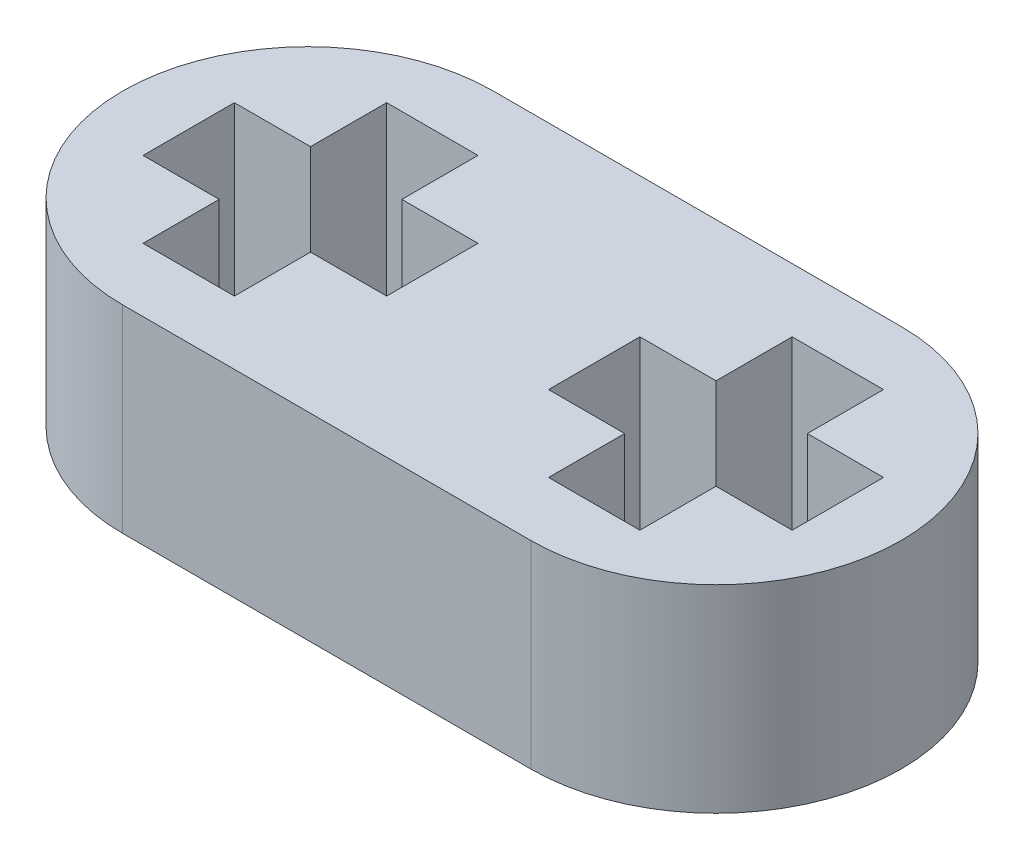
ISO-10303-21;
HEADER;
FILE_DESCRIPTION(('STEP AP214'),'2;1');
FILE_NAME('part.step','',(''),(''),'','','');
FILE_SCHEMA(('AUTOMOTIVE_DESIGN { 1 0 10303 214 1 1 1 1 }'));
ENDSEC;
DATA;
#1=APPLICATION_CONTEXT('core data for automotive mechanical design processes');
#2=APPLICATION_PROTOCOL_DEFINITION('international standard','automotive_design',2000,#1);
#3=PRODUCT_CONTEXT('',#1,'mechanical');
#4=PRODUCT('Part','Part','',(#3));
#5=PRODUCT_RELATED_PRODUCT_CATEGORY('part','',(#4));
#6=PRODUCT_DEFINITION_FORMATION('','',#4);
#7=PRODUCT_DEFINITION_CONTEXT('part definition',#1,'design');
#8=PRODUCT_DEFINITION('design','',#6,#7);
#9=PRODUCT_DEFINITION_SHAPE('','',#8);
#10=(LENGTH_UNIT() NAMED_UNIT(*) SI_UNIT(.MILLI.,.METRE.));
#11=(NAMED_UNIT(*) PLANE_ANGLE_UNIT() SI_UNIT($,.RADIAN.));
#12=(NAMED_UNIT(*) SI_UNIT($,.STERADIAN.) SOLID_ANGLE_UNIT());
#13=UNCERTAINTY_MEASURE_WITH_UNIT(LENGTH_MEASURE(1.E-05),#10,'distance_accuracy_value','');
#14=(GEOMETRIC_REPRESENTATION_CONTEXT(3) GLOBAL_UNCERTAINTY_ASSIGNED_CONTEXT((#13)) GLOBAL_UNIT_ASSIGNED_CONTEXT((#10,
#11,#12)) REPRESENTATION_CONTEXT('',''));
#15=CARTESIAN_POINT('',(0.,0.,0.));
#16=DIRECTION('',(0.,0.,1.));
#17=DIRECTION('',(1.,0.,0.));
#18=AXIS2_PLACEMENT_3D('',#15,#16,#17);
#19=CARTESIAN_POINT('',(-4.02,3.9,0.));
#20=DIRECTION('',(0.,1.,0.));
#21=DIRECTION('',(0.,0.,1.));
#22=AXIS2_PLACEMENT_3D('',#19,#20,#21);
#23=PLANE('',#22);
#24=CARTESIAN_POINT('',(-4.02,3.9,0.));
#25=DIRECTION('',(0.,1.,0.));
#26=DIRECTION('',(0.,0.,1.));
#27=AXIS2_PLACEMENT_3D('',#24,#25,#26);
#28=CIRCLE('',#27,3.65);
#29=CARTESIAN_POINT('',(-4.02,3.9,-3.65));
#30=VERTEX_POINT('',#29);
#31=CARTESIAN_POINT('',(-4.02,3.9,3.65));
#32=VERTEX_POINT('',#31);
#33=EDGE_CURVE('E402',#30,#32,#28,.T.);
#34=ORIENTED_EDGE('',*,*,#33,.T.);
#35=DIRECTION('',(1.,0.,0.));
#36=VECTOR('',#35,1.);
#37=CARTESIAN_POINT('',(-4.02,3.9,3.65));
#38=LINE('',#37,#36);
#39=CARTESIAN_POINT('',(4.02,3.9,3.65));
#40=VERTEX_POINT('',#39);
#41=EDGE_CURVE('E405',#32,#40,#38,.T.);
#42=ORIENTED_EDGE('',*,*,#41,.T.);
#43=CARTESIAN_POINT('',(4.02,3.9,0.));
#44=DIRECTION('',(0.,1.,0.));
#45=DIRECTION('',(0.,0.,1.));
#46=AXIS2_PLACEMENT_3D('',#43,#44,#45);
#47=CIRCLE('',#46,3.65);
#48=CARTESIAN_POINT('',(4.02,3.9,-3.65));
#49=VERTEX_POINT('',#48);
#50=EDGE_CURVE('E408',#40,#49,#47,.T.);
#51=ORIENTED_EDGE('',*,*,#50,.T.);
#52=DIRECTION('',(-1.,0.,0.));
#53=VECTOR('',#52,1.);
#54=CARTESIAN_POINT('',(-4.02,3.9,-3.65));
#55=LINE('',#54,#53);
#56=EDGE_CURVE('E410',#49,#30,#55,.T.);
#57=ORIENTED_EDGE('',*,*,#56,.T.);
#58=EDGE_LOOP('',(#34,#42,#51,#57));
#59=FACE_BOUND('',#58,.T.);
#60=DIRECTION('',(1.,0.,0.));
#61=VECTOR('',#60,1.);
#62=CARTESIAN_POINT('',(6.42,3.9,0.9));
#63=LINE('',#62,#61);
#64=CARTESIAN_POINT('',(4.92,3.9,0.900000000000001));
#65=VERTEX_POINT('',#64);
#66=CARTESIAN_POINT('',(6.42,3.9,0.9));
#67=VERTEX_POINT('',#66);
#68=EDGE_CURVE('E317',#65,#67,#63,.T.);
#69=ORIENTED_EDGE('',*,*,#68,.F.);
#70=DIRECTION('',(0.,0.,-1.));
#71=VECTOR('',#70,1.);
#72=CARTESIAN_POINT('',(4.92,3.9,0.900000000000001));
#73=LINE('',#72,#71);
#74=CARTESIAN_POINT('',(4.92,3.9,2.4));
#75=VERTEX_POINT('',#74);
#76=EDGE_CURVE('E315',#75,#65,#73,.T.);
#77=ORIENTED_EDGE('',*,*,#76,.F.);
#78=DIRECTION('',(1.,0.,0.));
#79=VECTOR('',#78,1.);
#80=CARTESIAN_POINT('',(3.12,3.9,2.4));
#81=LINE('',#80,#79);
#82=CARTESIAN_POINT('',(3.12,3.9,2.4));
#83=VERTEX_POINT('',#82);
#84=EDGE_CURVE('E339',#83,#75,#81,.T.);
#85=ORIENTED_EDGE('',*,*,#84,.F.);
#86=DIRECTION('',(0.,0.,1.));
#87=VECTOR('',#86,1.);
#88=CARTESIAN_POINT('',(3.12,3.9,0.900000000000001));
#89=LINE('',#88,#87);
#90=CARTESIAN_POINT('',(3.12,3.9,0.900000000000001));
#91=VERTEX_POINT('',#90);
#92=EDGE_CURVE('E336',#91,#83,#89,.T.);
#93=ORIENTED_EDGE('',*,*,#92,.F.);
#94=DIRECTION('',(1.,0.,0.));
#95=VECTOR('',#94,1.);
#96=CARTESIAN_POINT('',(3.12,3.9,0.900000000000001));
#97=LINE('',#96,#95);
#98=CARTESIAN_POINT('',(1.62,3.9,0.900000000000001));
#99=VERTEX_POINT('',#98);
#100=EDGE_CURVE('E334',#99,#91,#97,.T.);
#101=ORIENTED_EDGE('',*,*,#100,.F.);
#102=DIRECTION('',(0.,0.,1.));
#103=VECTOR('',#102,1.);
#104=CARTESIAN_POINT('',(1.62,3.9,0.900000000000001));
#105=LINE('',#104,#103);
#106=CARTESIAN_POINT('',(1.62,3.9,-0.899999999999997));
#107=VERTEX_POINT('',#106);
#108=EDGE_CURVE('E332',#107,#99,#105,.T.);
#109=ORIENTED_EDGE('',*,*,#108,.F.);
#110=DIRECTION('',(-1.,0.,0.));
#111=VECTOR('',#110,1.);
#112=CARTESIAN_POINT('',(3.12,3.9,-0.899999999999998));
#113=LINE('',#112,#111);
#114=CARTESIAN_POINT('',(3.12,3.9,-0.899999999999998));
#115=VERTEX_POINT('',#114);
#116=EDGE_CURVE('E330',#115,#107,#113,.T.);
#117=ORIENTED_EDGE('',*,*,#116,.F.);
#118=DIRECTION('',(0.,0.,1.));
#119=VECTOR('',#118,1.);
#120=CARTESIAN_POINT('',(3.12,3.9,-2.4));
#121=LINE('',#120,#119);
#122=CARTESIAN_POINT('',(3.12,3.9,-2.4));
#123=VERTEX_POINT('',#122);
#124=EDGE_CURVE('E328',#123,#115,#121,.T.);
#125=ORIENTED_EDGE('',*,*,#124,.F.);
#126=DIRECTION('',(-1.,0.,0.));
#127=VECTOR('',#126,1.);
#128=CARTESIAN_POINT('',(3.12,3.9,-2.4));
#129=LINE('',#128,#127);
#130=CARTESIAN_POINT('',(4.92,3.9,-2.4));
#131=VERTEX_POINT('',#130);
#132=EDGE_CURVE('E326',#131,#123,#129,.T.);
#133=ORIENTED_EDGE('',*,*,#132,.F.);
#134=DIRECTION('',(0.,0.,-1.));
#135=VECTOR('',#134,1.);
#136=CARTESIAN_POINT('',(4.92,3.9,-2.4));
#137=LINE('',#136,#135);
#138=CARTESIAN_POINT('',(4.92,3.9,-0.899999999999999));
#139=VERTEX_POINT('',#138);
#140=EDGE_CURVE('E324',#139,#131,#137,.T.);
#141=ORIENTED_EDGE('',*,*,#140,.F.);
#142=DIRECTION('',(-1.,0.,0.));
#143=VECTOR('',#142,1.);
#144=CARTESIAN_POINT('',(6.42,3.9,-0.9));
#145=LINE('',#144,#143);
#146=CARTESIAN_POINT('',(6.42,3.9,-0.9));
#147=VERTEX_POINT('',#146);
#148=EDGE_CURVE('E322',#147,#139,#145,.T.);
#149=ORIENTED_EDGE('',*,*,#148,.F.);
#150=DIRECTION('',(0.,0.,-1.));
#151=VECTOR('',#150,1.);
#152=CARTESIAN_POINT('',(6.42,3.9,0.9));
#153=LINE('',#152,#151);
#154=EDGE_CURVE('E320',#67,#147,#153,.T.);
#155=ORIENTED_EDGE('',*,*,#154,.F.);
#156=EDGE_LOOP('',(#69,#77,#85,#93,#101,#109,#117,#125,#133,#141,#149,#155));
#157=FACE_BOUND('',#156,.T.);
#158=DIRECTION('',(1.,0.,0.));
#159=VECTOR('',#158,1.);
#160=CARTESIAN_POINT('',(-1.57034753772958,3.9,0.899596713385413));
#161=LINE('',#160,#159);
#162=CARTESIAN_POINT('',(-3.07034753772958,3.9,0.899596713385412));
#163=VERTEX_POINT('',#162);
#164=CARTESIAN_POINT('',(-1.57034753772958,3.9,0.899596713385413));
#165=VERTEX_POINT('',#164);
#166=EDGE_CURVE('E230',#163,#165,#161,.T.);
#167=ORIENTED_EDGE('',*,*,#166,.F.);
#168=DIRECTION('',(0.,0.,-1.));
#169=VECTOR('',#168,1.);
#170=CARTESIAN_POINT('',(-3.07034753772958,3.9,0.899596713385412));
#171=LINE('',#170,#169);
#172=CARTESIAN_POINT('',(-3.07034753772958,3.9,2.39959671339153));
#173=VERTEX_POINT('',#172);
#174=EDGE_CURVE('E222',#173,#163,#171,.T.);
#175=ORIENTED_EDGE('',*,*,#174,.F.);
#176=DIRECTION('',(1.,0.,0.));
#177=VECTOR('',#176,1.);
#178=CARTESIAN_POINT('',(-4.87034753772958,3.9,2.39959671339153));
#179=LINE('',#178,#177);
#180=CARTESIAN_POINT('',(-4.87034753772958,3.9,2.39959671339153));
#181=VERTEX_POINT('',#180);
#182=EDGE_CURVE('E263',#181,#173,#179,.T.);
#183=ORIENTED_EDGE('',*,*,#182,.F.);
#184=DIRECTION('',(0.,0.,1.));
#185=VECTOR('',#184,1.);
#186=CARTESIAN_POINT('',(-4.87034753772958,3.9,0.899596713385413));
#187=LINE('',#186,#185);
#188=CARTESIAN_POINT('',(-4.87034753772958,3.9,0.899596713385413));
#189=VERTEX_POINT('',#188);
#190=EDGE_CURVE('E261',#189,#181,#187,.T.);
#191=ORIENTED_EDGE('',*,*,#190,.F.);
#192=DIRECTION('',(1.,0.,0.));
#193=VECTOR('',#192,1.);
#194=CARTESIAN_POINT('',(-4.87034753772958,3.9,0.899596713385413));
#195=LINE('',#194,#193);
#196=CARTESIAN_POINT('',(-6.37034753772958,3.9,0.899596713385413));
#197=VERTEX_POINT('',#196);
#198=EDGE_CURVE('E259',#197,#189,#195,.T.);
#199=ORIENTED_EDGE('',*,*,#198,.F.);
#200=DIRECTION('',(0.,0.,1.));
#201=VECTOR('',#200,1.);
#202=CARTESIAN_POINT('',(-6.37034753772958,3.9,0.899596713385413));
#203=LINE('',#202,#201);
#204=CARTESIAN_POINT('',(-6.37034753772958,3.9,-0.900403286614587));
#205=VERTEX_POINT('',#204);
#206=EDGE_CURVE('E257',#205,#197,#203,.T.);
#207=ORIENTED_EDGE('',*,*,#206,.F.);
#208=DIRECTION('',(-1.,0.,0.));
#209=VECTOR('',#208,1.);
#210=CARTESIAN_POINT('',(-4.87034753772958,3.9,-0.900403286614587));
#211=LINE('',#210,#209);
#212=CARTESIAN_POINT('',(-4.87034753772958,3.9,-0.900403286614587));
#213=VERTEX_POINT('',#212);
#214=EDGE_CURVE('E255',#213,#205,#211,.T.);
#215=ORIENTED_EDGE('',*,*,#214,.F.);
#216=DIRECTION('',(0.,0.,1.));
#217=VECTOR('',#216,1.);
#218=CARTESIAN_POINT('',(-4.87034753772958,3.9,-2.40040328660845));
#219=LINE('',#218,#217);
#220=CARTESIAN_POINT('',(-4.87034753772958,3.9,-2.40040328660845));
#221=VERTEX_POINT('',#220);
#222=EDGE_CURVE('E253',#221,#213,#219,.T.);
#223=ORIENTED_EDGE('',*,*,#222,.F.);
#224=DIRECTION('',(-1.,0.,0.));
#225=VECTOR('',#224,1.);
#226=CARTESIAN_POINT('',(-4.87034753772958,3.9,-2.40040328660845));
#227=LINE('',#226,#225);
#228=CARTESIAN_POINT('',(-3.07034753772958,3.9,-2.40040328660845));
#229=VERTEX_POINT('',#228);
#230=EDGE_CURVE('E251',#229,#221,#227,.T.);
#231=ORIENTED_EDGE('',*,*,#230,.F.);
#232=DIRECTION('',(0.,0.,-1.));
#233=VECTOR('',#232,1.);
#234=CARTESIAN_POINT('',(-3.07034753772958,3.9,-2.40040328660845));
#235=LINE('',#234,#233);
#236=CARTESIAN_POINT('',(-3.07034753772958,3.9,-0.900403286614588));
#237=VERTEX_POINT('',#236);
#238=EDGE_CURVE('E249',#237,#229,#235,.T.);
#239=ORIENTED_EDGE('',*,*,#238,.F.);
#240=DIRECTION('',(-1.,0.,0.));
#241=VECTOR('',#240,1.);
#242=CARTESIAN_POINT('',(-1.57034753772958,3.9,-0.900403286614588));
#243=LINE('',#242,#241);
#244=CARTESIAN_POINT('',(-1.57034753772958,3.9,-0.900403286614588));
#245=VERTEX_POINT('',#244);
#246=EDGE_CURVE('E245',#245,#237,#243,.T.);
#247=ORIENTED_EDGE('',*,*,#246,.F.);
#248=DIRECTION('',(0.,0.,-1.));
#249=VECTOR('',#248,1.);
#250=CARTESIAN_POINT('',(-1.57034753772958,3.9,0.899596713385413));
#251=LINE('',#250,#249);
#252=EDGE_CURVE('E243',#165,#245,#251,.T.);
#253=ORIENTED_EDGE('',*,*,#252,.F.);
#254=EDGE_LOOP('',(#167,#175,#183,#191,#199,#207,#215,#223,#231,#239,#247,#253));
#255=FACE_BOUND('',#254,.T.);
#256=ADVANCED_FACE('F37',(#59,#157,#255),#23,.T.);
#257=CARTESIAN_POINT('',(-4.02,0.,0.));
#258=DIRECTION('',(0.,1.,0.));
#259=DIRECTION('',(0.,0.,1.));
#260=AXIS2_PLACEMENT_3D('',#257,#258,#259);
#261=PLANE('',#260);
#262=DIRECTION('',(0.,0.,-1.));
#263=VECTOR('',#262,1.);
#264=CARTESIAN_POINT('',(4.92,0.,0.900000000000001));
#265=LINE('',#264,#263);
#266=CARTESIAN_POINT('',(4.92,0.,2.4));
#267=VERTEX_POINT('',#266);
#268=CARTESIAN_POINT('',(4.92,0.,0.900000000000001));
#269=VERTEX_POINT('',#268);
#270=EDGE_CURVE('E238',#267,#269,#265,.T.);
#271=ORIENTED_EDGE('',*,*,#270,.T.);
#272=DIRECTION('',(1.,0.,0.));
#273=VECTOR('',#272,1.);
#274=CARTESIAN_POINT('',(6.42,0.,0.9));
#275=LINE('',#274,#273);
#276=CARTESIAN_POINT('',(6.42,0.,0.9));
#277=VERTEX_POINT('',#276);
#278=EDGE_CURVE('E344',#269,#277,#275,.T.);
#279=ORIENTED_EDGE('',*,*,#278,.T.);
#280=DIRECTION('',(0.,0.,-1.));
#281=VECTOR('',#280,1.);
#282=CARTESIAN_POINT('',(6.42,0.,0.9));
#283=LINE('',#282,#281);
#284=CARTESIAN_POINT('',(6.42,0.,-0.9));
#285=VERTEX_POINT('',#284);
#286=EDGE_CURVE('E347',#277,#285,#283,.T.);
#287=ORIENTED_EDGE('',*,*,#286,.T.);
#288=DIRECTION('',(-1.,0.,0.));
#289=VECTOR('',#288,1.);
#290=CARTESIAN_POINT('',(6.42,0.,-0.9));
#291=LINE('',#290,#289);
#292=CARTESIAN_POINT('',(4.92,0.,-0.899999999999999));
#293=VERTEX_POINT('',#292);
#294=EDGE_CURVE('E350',#285,#293,#291,.T.);
#295=ORIENTED_EDGE('',*,*,#294,.T.);
#296=DIRECTION('',(0.,0.,-1.));
#297=VECTOR('',#296,1.);
#298=CARTESIAN_POINT('',(4.92,0.,-2.4));
#299=LINE('',#298,#297);
#300=CARTESIAN_POINT('',(4.92,0.,-2.4));
#301=VERTEX_POINT('',#300);
#302=EDGE_CURVE('E353',#293,#301,#299,.T.);
#303=ORIENTED_EDGE('',*,*,#302,.T.);
#304=DIRECTION('',(-1.,0.,0.));
#305=VECTOR('',#304,1.);
#306=CARTESIAN_POINT('',(3.12,0.,-2.4));
#307=LINE('',#306,#305);
#308=CARTESIAN_POINT('',(3.12,0.,-2.4));
#309=VERTEX_POINT('',#308);
#310=EDGE_CURVE('E356',#301,#309,#307,.T.);
#311=ORIENTED_EDGE('',*,*,#310,.T.);
#312=DIRECTION('',(0.,0.,1.));
#313=VECTOR('',#312,1.);
#314=CARTESIAN_POINT('',(3.12,0.,-2.4));
#315=LINE('',#314,#313);
#316=CARTESIAN_POINT('',(3.12,0.,-0.899999999999998));
#317=VERTEX_POINT('',#316);
#318=EDGE_CURVE('E359',#309,#317,#315,.T.);
#319=ORIENTED_EDGE('',*,*,#318,.T.);
#320=DIRECTION('',(-1.,0.,0.));
#321=VECTOR('',#320,1.);
#322=CARTESIAN_POINT('',(3.12,0.,-0.899999999999998));
#323=LINE('',#322,#321);
#324=CARTESIAN_POINT('',(1.62,0.,-0.899999999999997));
#325=VERTEX_POINT('',#324);
#326=EDGE_CURVE('E362',#317,#325,#323,.T.);
#327=ORIENTED_EDGE('',*,*,#326,.T.);
#328=DIRECTION('',(0.,0.,1.));
#329=VECTOR('',#328,1.);
#330=CARTESIAN_POINT('',(1.62,0.,0.900000000000001));
#331=LINE('',#330,#329);
#332=CARTESIAN_POINT('',(1.62,0.,0.900000000000001));
#333=VERTEX_POINT('',#332);
#334=EDGE_CURVE('E365',#325,#333,#331,.T.);
#335=ORIENTED_EDGE('',*,*,#334,.T.);
#336=DIRECTION('',(1.,0.,0.));
#337=VECTOR('',#336,1.);
#338=CARTESIAN_POINT('',(3.12,0.,0.900000000000001));
#339=LINE('',#338,#337);
#340=CARTESIAN_POINT('',(3.12,0.,0.900000000000001));
#341=VERTEX_POINT('',#340);
#342=EDGE_CURVE('E368',#333,#341,#339,.T.);
#343=ORIENTED_EDGE('',*,*,#342,.T.);
#344=DIRECTION('',(0.,0.,1.));
#345=VECTOR('',#344,1.);
#346=CARTESIAN_POINT('',(3.12,0.,0.900000000000001));
#347=LINE('',#346,#345);
#348=CARTESIAN_POINT('',(3.12,0.,2.4));
#349=VERTEX_POINT('',#348);
#350=EDGE_CURVE('E371',#341,#349,#347,.T.);
#351=ORIENTED_EDGE('',*,*,#350,.T.);
#352=DIRECTION('',(1.,0.,0.));
#353=VECTOR('',#352,1.);
#354=CARTESIAN_POINT('',(3.12,0.,2.4));
#355=LINE('',#354,#353);
#356=EDGE_CURVE('E318',#349,#267,#355,.T.);
#357=ORIENTED_EDGE('',*,*,#356,.T.);
#358=EDGE_LOOP('',(#271,#279,#287,#295,#303,#311,#319,#327,#335,#343,#351,#357));
#359=FACE_BOUND('',#358,.T.);
#360=CARTESIAN_POINT('',(-4.02,0.,0.));
#361=DIRECTION('',(0.,1.,0.));
#362=DIRECTION('',(0.,0.,1.));
#363=AXIS2_PLACEMENT_3D('',#360,#361,#362);
#364=CIRCLE('',#363,3.65);
#365=CARTESIAN_POINT('',(-4.02,0.,-3.65));
#366=VERTEX_POINT('',#365);
#367=CARTESIAN_POINT('',(-4.02,0.,3.65));
#368=VERTEX_POINT('',#367);
#369=EDGE_CURVE('E401',#366,#368,#364,.T.);
#370=ORIENTED_EDGE('',*,*,#369,.F.);
#371=DIRECTION('',(-1.,0.,0.));
#372=VECTOR('',#371,1.);
#373=CARTESIAN_POINT('',(-4.02,0.,-3.65));
#374=LINE('',#373,#372);
#375=CARTESIAN_POINT('',(4.02,0.,-3.65));
#376=VERTEX_POINT('',#375);
#377=EDGE_CURVE('E406',#376,#366,#374,.T.);
#378=ORIENTED_EDGE('',*,*,#377,.F.);
#379=CARTESIAN_POINT('',(4.02,0.,0.));
#380=DIRECTION('',(0.,1.,0.));
#381=DIRECTION('',(0.,0.,1.));
#382=AXIS2_PLACEMENT_3D('',#379,#380,#381);
#383=CIRCLE('',#382,3.65);
#384=CARTESIAN_POINT('',(4.02,0.,3.65));
#385=VERTEX_POINT('',#384);
#386=EDGE_CURVE('E417',#385,#376,#383,.T.);
#387=ORIENTED_EDGE('',*,*,#386,.F.);
#388=DIRECTION('',(1.,0.,0.));
#389=VECTOR('',#388,1.);
#390=CARTESIAN_POINT('',(-4.02,0.,3.65));
#391=LINE('',#390,#389);
#392=EDGE_CURVE('E415',#368,#385,#391,.T.);
#393=ORIENTED_EDGE('',*,*,#392,.F.);
#394=EDGE_LOOP('',(#370,#378,#387,#393));
#395=FACE_BOUND('',#394,.T.);
#396=DIRECTION('',(0.,0.,-1.));
#397=VECTOR('',#396,1.);
#398=CARTESIAN_POINT('',(-3.07034753772958,0.,0.899596713385412));
#399=LINE('',#398,#397);
#400=CARTESIAN_POINT('',(-3.07034753772958,0.,2.39959671339153));
#401=VERTEX_POINT('',#400);
#402=CARTESIAN_POINT('',(-3.07034753772958,0.,0.899596713385412));
#403=VERTEX_POINT('',#402);
#404=EDGE_CURVE('E60',#401,#403,#399,.T.);
#405=ORIENTED_EDGE('',*,*,#404,.T.);
#406=DIRECTION('',(1.,0.,0.));
#407=VECTOR('',#406,1.);
#408=CARTESIAN_POINT('',(-1.57034753772958,0.,0.899596713385413));
#409=LINE('',#408,#407);
#410=CARTESIAN_POINT('',(-1.57034753772958,0.,0.899596713385413));
#411=VERTEX_POINT('',#410);
#412=EDGE_CURVE('E237',#403,#411,#409,.T.);
#413=ORIENTED_EDGE('',*,*,#412,.T.);
#414=DIRECTION('',(0.,0.,-1.));
#415=VECTOR('',#414,1.);
#416=CARTESIAN_POINT('',(-1.57034753772958,0.,0.899596713385413));
#417=LINE('',#416,#415);
#418=CARTESIAN_POINT('',(-1.57034753772958,0.,-0.900403286614588));
#419=VERTEX_POINT('',#418);
#420=EDGE_CURVE('E267',#411,#419,#417,.T.);
#421=ORIENTED_EDGE('',*,*,#420,.T.);
#422=DIRECTION('',(-1.,0.,0.));
#423=VECTOR('',#422,1.);
#424=CARTESIAN_POINT('',(-1.57034753772958,0.,-0.900403286614588));
#425=LINE('',#424,#423);
#426=CARTESIAN_POINT('',(-3.07034753772958,0.,-0.900403286614588));
#427=VERTEX_POINT('',#426);
#428=EDGE_CURVE('E270',#419,#427,#425,.T.);
#429=ORIENTED_EDGE('',*,*,#428,.T.);
#430=DIRECTION('',(0.,0.,-1.));
#431=VECTOR('',#430,1.);
#432=CARTESIAN_POINT('',(-3.07034753772958,0.,-2.40040328660845));
#433=LINE('',#432,#431);
#434=CARTESIAN_POINT('',(-3.07034753772958,0.,-2.40040328660845));
#435=VERTEX_POINT('',#434);
#436=EDGE_CURVE('E273',#427,#435,#433,.T.);
#437=ORIENTED_EDGE('',*,*,#436,.T.);
#438=DIRECTION('',(-1.,0.,0.));
#439=VECTOR('',#438,1.);
#440=CARTESIAN_POINT('',(-4.87034753772958,0.,-2.40040328660845));
#441=LINE('',#440,#439);
#442=CARTESIAN_POINT('',(-4.87034753772958,0.,-2.40040328660845));
#443=VERTEX_POINT('',#442);
#444=EDGE_CURVE('E276',#435,#443,#441,.T.);
#445=ORIENTED_EDGE('',*,*,#444,.T.);
#446=DIRECTION('',(0.,0.,1.));
#447=VECTOR('',#446,1.);
#448=CARTESIAN_POINT('',(-4.87034753772958,0.,-2.40040328660845));
#449=LINE('',#448,#447);
#450=CARTESIAN_POINT('',(-4.87034753772958,0.,-0.900403286614587));
#451=VERTEX_POINT('',#450);
#452=EDGE_CURVE('E279',#443,#451,#449,.T.);
#453=ORIENTED_EDGE('',*,*,#452,.T.);
#454=DIRECTION('',(-1.,0.,0.));
#455=VECTOR('',#454,1.);
#456=CARTESIAN_POINT('',(-4.87034753772958,0.,-0.900403286614587));
#457=LINE('',#456,#455);
#458=CARTESIAN_POINT('',(-6.37034753772958,0.,-0.900403286614587));
#459=VERTEX_POINT('',#458);
#460=EDGE_CURVE('E282',#451,#459,#457,.T.);
#461=ORIENTED_EDGE('',*,*,#460,.T.);
#462=DIRECTION('',(0.,0.,1.));
#463=VECTOR('',#462,1.);
#464=CARTESIAN_POINT('',(-6.37034753772958,0.,0.899596713385413));
#465=LINE('',#464,#463);
#466=CARTESIAN_POINT('',(-6.37034753772958,0.,0.899596713385413));
#467=VERTEX_POINT('',#466);
#468=EDGE_CURVE('E285',#459,#467,#465,.T.);
#469=ORIENTED_EDGE('',*,*,#468,.T.);
#470=DIRECTION('',(1.,0.,0.));
#471=VECTOR('',#470,1.);
#472=CARTESIAN_POINT('',(-4.87034753772958,0.,0.899596713385413));
#473=LINE('',#472,#471);
#474=CARTESIAN_POINT('',(-4.87034753772958,0.,0.899596713385413));
#475=VERTEX_POINT('',#474);
#476=EDGE_CURVE('E288',#467,#475,#473,.T.);
#477=ORIENTED_EDGE('',*,*,#476,.T.);
#478=DIRECTION('',(0.,0.,1.));
#479=VECTOR('',#478,1.);
#480=CARTESIAN_POINT('',(-4.87034753772958,0.,0.899596713385413));
#481=LINE('',#480,#479);
#482=CARTESIAN_POINT('',(-4.87034753772958,0.,2.39959671339153));
#483=VERTEX_POINT('',#482);
#484=EDGE_CURVE('E291',#475,#483,#481,.T.);
#485=ORIENTED_EDGE('',*,*,#484,.T.);
#486=DIRECTION('',(1.,0.,0.));
#487=VECTOR('',#486,1.);
#488=CARTESIAN_POINT('',(-4.87034753772958,0.,2.39959671339153));
#489=LINE('',#488,#487);
#490=EDGE_CURVE('E231',#483,#401,#489,.T.);
#491=ORIENTED_EDGE('',*,*,#490,.T.);
#492=EDGE_LOOP('',(#405,#413,#421,#429,#437,#445,#453,#461,#469,#477,#485,#491));
#493=FACE_BOUND('',#492,.T.);
#494=ADVANCED_FACE('F435',(#359,#395,#493),#261,.F.);
#495=CARTESIAN_POINT('',(-4.02,3.9,0.));
#496=DIRECTION('',(0.,-1.,0.));
#497=DIRECTION('',(0.,0.,-1.));
#498=AXIS2_PLACEMENT_3D('',#495,#496,#497);
#499=CYLINDRICAL_SURFACE('',#498,3.65);
#500=ORIENTED_EDGE('',*,*,#369,.T.);
#501=DIRECTION('',(0.,-1.,0.));
#502=VECTOR('',#501,1.);
#503=CARTESIAN_POINT('',(-4.02,3.9,3.65));
#504=LINE('',#503,#502);
#505=EDGE_CURVE('E11',#32,#368,#504,.T.);
#506=ORIENTED_EDGE('',*,*,#505,.F.);
#507=ORIENTED_EDGE('',*,*,#33,.F.);
#508=DIRECTION('',(0.,-1.,0.));
#509=VECTOR('',#508,1.);
#510=CARTESIAN_POINT('',(-4.02,3.9,-3.65));
#511=LINE('',#510,#509);
#512=EDGE_CURVE('E412',#30,#366,#511,.T.);
#513=ORIENTED_EDGE('',*,*,#512,.T.);
#514=EDGE_LOOP('',(#500,#506,#507,#513));
#515=FACE_BOUND('',#514,.T.);
#516=ADVANCED_FACE('F39',(#515),#499,.T.);
#517=CARTESIAN_POINT('',(-4.02,3.9,3.65));
#518=DIRECTION('',(0.,0.,-1.));
#519=DIRECTION('',(-1.,0.,0.));
#520=AXIS2_PLACEMENT_3D('',#517,#518,#519);
#521=PLANE('',#520);
#522=ORIENTED_EDGE('',*,*,#392,.T.);
#523=DIRECTION('',(0.,-1.,0.));
#524=VECTOR('',#523,1.);
#525=CARTESIAN_POINT('',(4.02,3.9,3.65));
#526=LINE('',#525,#524);
#527=EDGE_CURVE('E45',#40,#385,#526,.T.);
#528=ORIENTED_EDGE('',*,*,#527,.F.);
#529=ORIENTED_EDGE('',*,*,#41,.F.);
#530=ORIENTED_EDGE('',*,*,#505,.T.);
#531=EDGE_LOOP('',(#522,#528,#529,#530));
#532=FACE_BOUND('',#531,.T.);
#533=ADVANCED_FACE('F446',(#532),#521,.F.);
#534=CARTESIAN_POINT('',(4.02,3.9,0.));
#535=DIRECTION('',(0.,-1.,0.));
#536=DIRECTION('',(0.,0.,-1.));
#537=AXIS2_PLACEMENT_3D('',#534,#535,#536);
#538=CYLINDRICAL_SURFACE('',#537,3.65);
#539=ORIENTED_EDGE('',*,*,#386,.T.);
#540=DIRECTION('',(0.,-1.,0.));
#541=VECTOR('',#540,1.);
#542=CARTESIAN_POINT('',(4.02,3.9,-3.65));
#543=LINE('',#542,#541);
#544=EDGE_CURVE('E422',#49,#376,#543,.T.);
#545=ORIENTED_EDGE('',*,*,#544,.F.);
#546=ORIENTED_EDGE('',*,*,#50,.F.);
#547=ORIENTED_EDGE('',*,*,#527,.T.);
#548=EDGE_LOOP('',(#539,#545,#546,#547));
#549=FACE_BOUND('',#548,.T.);
#550=ADVANCED_FACE('F429',(#549),#538,.T.);
#551=CARTESIAN_POINT('',(-4.02,3.9,-3.65));
#552=DIRECTION('',(0.,0.,1.));
#553=DIRECTION('',(1.,0.,0.));
#554=AXIS2_PLACEMENT_3D('',#551,#552,#553);
#555=PLANE('',#554);
#556=ORIENTED_EDGE('',*,*,#377,.T.);
#557=ORIENTED_EDGE('',*,*,#512,.F.);
#558=ORIENTED_EDGE('',*,*,#56,.F.);
#559=ORIENTED_EDGE('',*,*,#544,.T.);
#560=EDGE_LOOP('',(#556,#557,#558,#559));
#561=FACE_BOUND('',#560,.T.);
#562=ADVANCED_FACE('F439',(#561),#555,.F.);
#563=CARTESIAN_POINT('',(4.92,3.9,0.900000000000001));
#564=DIRECTION('',(-1.,0.,0.));
#565=DIRECTION('',(0.,0.,1.));
#566=AXIS2_PLACEMENT_3D('',#563,#564,#565);
#567=PLANE('',#566);
#568=ORIENTED_EDGE('',*,*,#270,.F.);
#569=DIRECTION('',(0.,-1.,0.));
#570=VECTOR('',#569,1.);
#571=CARTESIAN_POINT('',(4.92,3.9,2.4));
#572=LINE('',#571,#570);
#573=EDGE_CURVE('E341',#75,#267,#572,.T.);
#574=ORIENTED_EDGE('',*,*,#573,.F.);
#575=ORIENTED_EDGE('',*,*,#76,.T.);
#576=DIRECTION('',(0.,-1.,0.));
#577=VECTOR('',#576,1.);
#578=CARTESIAN_POINT('',(4.92,3.9,0.900000000000001));
#579=LINE('',#578,#577);
#580=EDGE_CURVE('E398',#65,#269,#579,.T.);
#581=ORIENTED_EDGE('',*,*,#580,.T.);
#582=EDGE_LOOP('',(#568,#574,#575,#581));
#583=FACE_BOUND('',#582,.T.);
#584=ADVANCED_FACE('F461',(#583),#567,.T.);
#585=CARTESIAN_POINT('',(6.42,3.9,0.9));
#586=DIRECTION('',(0.,0.,-1.));
#587=DIRECTION('',(-1.,0.,0.));
#588=AXIS2_PLACEMENT_3D('',#585,#586,#587);
#589=PLANE('',#588);
#590=ORIENTED_EDGE('',*,*,#278,.F.);
#591=ORIENTED_EDGE('',*,*,#580,.F.);
#592=ORIENTED_EDGE('',*,*,#68,.T.);
#593=DIRECTION('',(0.,-1.,0.));
#594=VECTOR('',#593,1.);
#595=CARTESIAN_POINT('',(6.42,3.9,0.9));
#596=LINE('',#595,#594);
#597=EDGE_CURVE('E396',#67,#277,#596,.T.);
#598=ORIENTED_EDGE('',*,*,#597,.T.);
#599=EDGE_LOOP('',(#590,#591,#592,#598));
#600=FACE_BOUND('',#599,.T.);
#601=ADVANCED_FACE('F468',(#600),#589,.T.);
#602=CARTESIAN_POINT('',(6.42,3.9,0.9));
#603=DIRECTION('',(-1.,0.,0.));
#604=DIRECTION('',(0.,0.,1.));
#605=AXIS2_PLACEMENT_3D('',#602,#603,#604);
#606=PLANE('',#605);
#607=ORIENTED_EDGE('',*,*,#286,.F.);
#608=ORIENTED_EDGE('',*,*,#597,.F.);
#609=ORIENTED_EDGE('',*,*,#154,.T.);
#610=DIRECTION('',(0.,-1.,0.));
#611=VECTOR('',#610,1.);
#612=CARTESIAN_POINT('',(6.42,3.9,-0.9));
#613=LINE('',#612,#611);
#614=EDGE_CURVE('E394',#147,#285,#613,.T.);
#615=ORIENTED_EDGE('',*,*,#614,.T.);
#616=EDGE_LOOP('',(#607,#608,#609,#615));
#617=FACE_BOUND('',#616,.T.);
#618=ADVANCED_FACE('F473',(#617),#606,.T.);
#619=CARTESIAN_POINT('',(6.42,3.9,-0.9));
#620=DIRECTION('',(0.,0.,1.));
#621=DIRECTION('',(1.,0.,0.));
#622=AXIS2_PLACEMENT_3D('',#619,#620,#621);
#623=PLANE('',#622);
#624=ORIENTED_EDGE('',*,*,#294,.F.);
#625=ORIENTED_EDGE('',*,*,#614,.F.);
#626=ORIENTED_EDGE('',*,*,#148,.T.);
#627=DIRECTION('',(0.,-1.,0.));
#628=VECTOR('',#627,1.);
#629=CARTESIAN_POINT('',(4.92,3.9,-0.899999999999999));
#630=LINE('',#629,#628);
#631=EDGE_CURVE('E392',#139,#293,#630,.T.);
#632=ORIENTED_EDGE('',*,*,#631,.T.);
#633=EDGE_LOOP('',(#624,#625,#626,#632));
#634=FACE_BOUND('',#633,.T.);
#635=ADVANCED_FACE('F498',(#634),#623,.T.);
#636=CARTESIAN_POINT('',(4.92,3.9,-2.4));
#637=DIRECTION('',(-1.,0.,0.));
#638=DIRECTION('',(0.,0.,1.));
#639=AXIS2_PLACEMENT_3D('',#636,#637,#638);
#640=PLANE('',#639);
#641=ORIENTED_EDGE('',*,*,#302,.F.);
#642=ORIENTED_EDGE('',*,*,#631,.F.);
#643=ORIENTED_EDGE('',*,*,#140,.T.);
#644=DIRECTION('',(0.,-1.,0.));
#645=VECTOR('',#644,1.);
#646=CARTESIAN_POINT('',(4.92,3.9,-2.4));
#647=LINE('',#646,#645);
#648=EDGE_CURVE('E390',#131,#301,#647,.T.);
#649=ORIENTED_EDGE('',*,*,#648,.T.);
#650=EDGE_LOOP('',(#641,#642,#643,#649));
#651=FACE_BOUND('',#650,.T.);
#652=ADVANCED_FACE('F503',(#651),#640,.T.);
#653=CARTESIAN_POINT('',(3.12,3.9,-2.4));
#654=DIRECTION('',(0.,0.,1.));
#655=DIRECTION('',(1.,0.,0.));
#656=AXIS2_PLACEMENT_3D('',#653,#654,#655);
#657=PLANE('',#656);
#658=ORIENTED_EDGE('',*,*,#310,.F.);
#659=ORIENTED_EDGE('',*,*,#648,.F.);
#660=ORIENTED_EDGE('',*,*,#132,.T.);
#661=DIRECTION('',(0.,-1.,0.));
#662=VECTOR('',#661,1.);
#663=CARTESIAN_POINT('',(3.12,3.9,-2.4));
#664=LINE('',#663,#662);
#665=EDGE_CURVE('E388',#123,#309,#664,.T.);
#666=ORIENTED_EDGE('',*,*,#665,.T.);
#667=EDGE_LOOP('',(#658,#659,#660,#666));
#668=FACE_BOUND('',#667,.T.);
#669=ADVANCED_FACE('F508',(#668),#657,.T.);
#670=CARTESIAN_POINT('',(3.12,3.9,-2.4));
#671=DIRECTION('',(1.,0.,0.));
#672=DIRECTION('',(0.,0.,-1.));
#673=AXIS2_PLACEMENT_3D('',#670,#671,#672);
#674=PLANE('',#673);
#675=ORIENTED_EDGE('',*,*,#318,.F.);
#676=ORIENTED_EDGE('',*,*,#665,.F.);
#677=ORIENTED_EDGE('',*,*,#124,.T.);
#678=DIRECTION('',(0.,-1.,0.));
#679=VECTOR('',#678,1.);
#680=CARTESIAN_POINT('',(3.12,3.9,-0.899999999999998));
#681=LINE('',#680,#679);
#682=EDGE_CURVE('E386',#115,#317,#681,.T.);
#683=ORIENTED_EDGE('',*,*,#682,.T.);
#684=EDGE_LOOP('',(#675,#676,#677,#683));
#685=FACE_BOUND('',#684,.T.);
#686=ADVANCED_FACE('F513',(#685),#674,.T.);
#687=CARTESIAN_POINT('',(3.12,3.9,-0.899999999999998));
#688=DIRECTION('',(0.,0.,1.));
#689=DIRECTION('',(1.,0.,0.));
#690=AXIS2_PLACEMENT_3D('',#687,#688,#689);
#691=PLANE('',#690);
#692=ORIENTED_EDGE('',*,*,#326,.F.);
#693=ORIENTED_EDGE('',*,*,#682,.F.);
#694=ORIENTED_EDGE('',*,*,#116,.T.);
#695=DIRECTION('',(0.,-1.,0.));
#696=VECTOR('',#695,1.);
#697=CARTESIAN_POINT('',(1.62,3.9,-0.899999999999997));
#698=LINE('',#697,#696);
#699=EDGE_CURVE('E384',#107,#325,#698,.T.);
#700=ORIENTED_EDGE('',*,*,#699,.T.);
#701=EDGE_LOOP('',(#692,#693,#694,#700));
#702=FACE_BOUND('',#701,.T.);
#703=ADVANCED_FACE('F518',(#702),#691,.T.);
#704=CARTESIAN_POINT('',(1.62,3.9,0.900000000000001));
#705=DIRECTION('',(1.,0.,0.));
#706=DIRECTION('',(0.,0.,-1.));
#707=AXIS2_PLACEMENT_3D('',#704,#705,#706);
#708=PLANE('',#707);
#709=ORIENTED_EDGE('',*,*,#334,.F.);
#710=ORIENTED_EDGE('',*,*,#699,.F.);
#711=ORIENTED_EDGE('',*,*,#108,.T.);
#712=DIRECTION('',(0.,-1.,0.));
#713=VECTOR('',#712,1.);
#714=CARTESIAN_POINT('',(1.62,3.9,0.900000000000001));
#715=LINE('',#714,#713);
#716=EDGE_CURVE('E382',#99,#333,#715,.T.);
#717=ORIENTED_EDGE('',*,*,#716,.T.);
#718=EDGE_LOOP('',(#709,#710,#711,#717));
#719=FACE_BOUND('',#718,.T.);
#720=ADVANCED_FACE('F522',(#719),#708,.T.);
#721=CARTESIAN_POINT('',(3.12,3.9,0.900000000000001));
#722=DIRECTION('',(0.,0.,-1.));
#723=DIRECTION('',(-1.,0.,0.));
#724=AXIS2_PLACEMENT_3D('',#721,#722,#723);
#725=PLANE('',#724);
#726=ORIENTED_EDGE('',*,*,#342,.F.);
#727=ORIENTED_EDGE('',*,*,#716,.F.);
#728=ORIENTED_EDGE('',*,*,#100,.T.);
#729=DIRECTION('',(0.,-1.,0.));
#730=VECTOR('',#729,1.);
#731=CARTESIAN_POINT('',(3.12,3.9,0.900000000000001));
#732=LINE('',#731,#730);
#733=EDGE_CURVE('E380',#91,#341,#732,.T.);
#734=ORIENTED_EDGE('',*,*,#733,.T.);
#735=EDGE_LOOP('',(#726,#727,#728,#734));
#736=FACE_BOUND('',#735,.T.);
#737=ADVANCED_FACE('F526',(#736),#725,.T.);
#738=CARTESIAN_POINT('',(3.12,3.9,0.900000000000001));
#739=DIRECTION('',(1.,0.,0.));
#740=DIRECTION('',(0.,0.,-1.));
#741=AXIS2_PLACEMENT_3D('',#738,#739,#740);
#742=PLANE('',#741);
#743=ORIENTED_EDGE('',*,*,#350,.F.);
#744=ORIENTED_EDGE('',*,*,#733,.F.);
#745=ORIENTED_EDGE('',*,*,#92,.T.);
#746=DIRECTION('',(0.,-1.,0.));
#747=VECTOR('',#746,1.);
#748=CARTESIAN_POINT('',(3.12,3.9,2.4));
#749=LINE('',#748,#747);
#750=EDGE_CURVE('E378',#83,#349,#749,.T.);
#751=ORIENTED_EDGE('',*,*,#750,.T.);
#752=EDGE_LOOP('',(#743,#744,#745,#751));
#753=FACE_BOUND('',#752,.T.);
#754=ADVANCED_FACE('F486',(#753),#742,.T.);
#755=CARTESIAN_POINT('',(3.12,3.9,2.4));
#756=DIRECTION('',(0.,0.,-1.));
#757=DIRECTION('',(-1.,0.,0.));
#758=AXIS2_PLACEMENT_3D('',#755,#756,#757);
#759=PLANE('',#758);
#760=ORIENTED_EDGE('',*,*,#356,.F.);
#761=ORIENTED_EDGE('',*,*,#750,.F.);
#762=ORIENTED_EDGE('',*,*,#84,.T.);
#763=ORIENTED_EDGE('',*,*,#573,.T.);
#764=EDGE_LOOP('',(#760,#761,#762,#763));
#765=FACE_BOUND('',#764,.T.);
#766=ADVANCED_FACE('F480',(#765),#759,.T.);
#767=CARTESIAN_POINT('',(-3.07034753772958,3.9,0.899596713385412));
#768=DIRECTION('',(-1.,0.,0.));
#769=DIRECTION('',(0.,0.,1.));
#770=AXIS2_PLACEMENT_3D('',#767,#768,#769);
#771=PLANE('',#770);
#772=ORIENTED_EDGE('',*,*,#404,.F.);
#773=DIRECTION('',(0.,-1.,0.));
#774=VECTOR('',#773,1.);
#775=CARTESIAN_POINT('',(-3.07034753772958,3.9,2.39959671339153));
#776=LINE('',#775,#774);
#777=EDGE_CURVE('E226',#173,#401,#776,.T.);
#778=ORIENTED_EDGE('',*,*,#777,.F.);
#779=ORIENTED_EDGE('',*,*,#174,.T.);
#780=DIRECTION('',(0.,-1.,0.));
#781=VECTOR('',#780,1.);
#782=CARTESIAN_POINT('',(-3.07034753772958,3.9,0.899596713385412));
#783=LINE('',#782,#781);
#784=EDGE_CURVE('E225',#163,#403,#783,.T.);
#785=ORIENTED_EDGE('',*,*,#784,.T.);
#786=EDGE_LOOP('',(#772,#778,#779,#785));
#787=FACE_BOUND('',#786,.T.);
#788=ADVANCED_FACE('F224',(#787),#771,.T.);
#789=CARTESIAN_POINT('',(-1.57034753772958,3.9,0.899596713385413));
#790=DIRECTION('',(0.,0.,-1.));
#791=DIRECTION('',(-1.,0.,0.));
#792=AXIS2_PLACEMENT_3D('',#789,#790,#791);
#793=PLANE('',#792);
#794=ORIENTED_EDGE('',*,*,#412,.F.);
#795=ORIENTED_EDGE('',*,*,#784,.F.);
#796=ORIENTED_EDGE('',*,*,#166,.T.);
#797=DIRECTION('',(0.,-1.,0.));
#798=VECTOR('',#797,1.);
#799=CARTESIAN_POINT('',(-1.57034753772958,3.9,0.899596713385413));
#800=LINE('',#799,#798);
#801=EDGE_CURVE('E239',#165,#411,#800,.T.);
#802=ORIENTED_EDGE('',*,*,#801,.T.);
#803=EDGE_LOOP('',(#794,#795,#796,#802));
#804=FACE_BOUND('',#803,.T.);
#805=ADVANCED_FACE('F234',(#804),#793,.T.);
#806=CARTESIAN_POINT('',(-1.57034753772958,3.9,0.899596713385413));
#807=DIRECTION('',(-1.,0.,0.));
#808=DIRECTION('',(0.,0.,1.));
#809=AXIS2_PLACEMENT_3D('',#806,#807,#808);
#810=PLANE('',#809);
#811=ORIENTED_EDGE('',*,*,#420,.F.);
#812=ORIENTED_EDGE('',*,*,#801,.F.);
#813=ORIENTED_EDGE('',*,*,#252,.T.);
#814=DIRECTION('',(0.,-1.,0.));
#815=VECTOR('',#814,1.);
#816=CARTESIAN_POINT('',(-1.57034753772958,3.9,-0.900403286614588));
#817=LINE('',#816,#815);
#818=EDGE_CURVE('E312',#245,#419,#817,.T.);
#819=ORIENTED_EDGE('',*,*,#818,.T.);
#820=EDGE_LOOP('',(#811,#812,#813,#819));
#821=FACE_BOUND('',#820,.T.);
#822=ADVANCED_FACE('F610',(#821),#810,.T.);
#823=CARTESIAN_POINT('',(-1.57034753772958,3.9,-0.900403286614588));
#824=DIRECTION('',(0.,0.,1.));
#825=DIRECTION('',(1.,0.,0.));
#826=AXIS2_PLACEMENT_3D('',#823,#824,#825);
#827=PLANE('',#826);
#828=ORIENTED_EDGE('',*,*,#428,.F.);
#829=ORIENTED_EDGE('',*,*,#818,.F.);
#830=ORIENTED_EDGE('',*,*,#246,.T.);
#831=DIRECTION('',(0.,-1.,0.));
#832=VECTOR('',#831,1.);
#833=CARTESIAN_POINT('',(-3.07034753772958,3.9,-0.900403286614588));
#834=LINE('',#833,#832);
#835=EDGE_CURVE('E310',#237,#427,#834,.T.);
#836=ORIENTED_EDGE('',*,*,#835,.T.);
#837=EDGE_LOOP('',(#828,#829,#830,#836));
#838=FACE_BOUND('',#837,.T.);
#839=ADVANCED_FACE('F619',(#838),#827,.T.);
#840=CARTESIAN_POINT('',(-3.07034753772958,3.9,-2.40040328660845));
#841=DIRECTION('',(-1.,0.,0.));
#842=DIRECTION('',(0.,0.,1.));
#843=AXIS2_PLACEMENT_3D('',#840,#841,#842);
#844=PLANE('',#843);
#845=ORIENTED_EDGE('',*,*,#436,.F.);
#846=ORIENTED_EDGE('',*,*,#835,.F.);
#847=ORIENTED_EDGE('',*,*,#238,.T.);
#848=DIRECTION('',(0.,-1.,0.));
#849=VECTOR('',#848,1.);
#850=CARTESIAN_POINT('',(-3.07034753772958,3.9,-2.40040328660845));
#851=LINE('',#850,#849);
#852=EDGE_CURVE('E308',#229,#435,#851,.T.);
#853=ORIENTED_EDGE('',*,*,#852,.T.);
#854=EDGE_LOOP('',(#845,#846,#847,#853));
#855=FACE_BOUND('',#854,.T.);
#856=ADVANCED_FACE('F629',(#855),#844,.T.);
#857=CARTESIAN_POINT('',(-4.87034753772958,3.9,-2.40040328660845));
#858=DIRECTION('',(0.,0.,1.));
#859=DIRECTION('',(1.,0.,0.));
#860=AXIS2_PLACEMENT_3D('',#857,#858,#859);
#861=PLANE('',#860);
#862=ORIENTED_EDGE('',*,*,#444,.F.);
#863=ORIENTED_EDGE('',*,*,#852,.F.);
#864=ORIENTED_EDGE('',*,*,#230,.T.);
#865=DIRECTION('',(0.,-1.,0.));
#866=VECTOR('',#865,1.);
#867=CARTESIAN_POINT('',(-4.87034753772958,3.9,-2.40040328660845));
#868=LINE('',#867,#866);
#869=EDGE_CURVE('E306',#221,#443,#868,.T.);
#870=ORIENTED_EDGE('',*,*,#869,.T.);
#871=EDGE_LOOP('',(#862,#863,#864,#870));
#872=FACE_BOUND('',#871,.T.);
#873=ADVANCED_FACE('F639',(#872),#861,.T.);
#874=CARTESIAN_POINT('',(-4.87034753772958,3.9,-2.40040328660845));
#875=DIRECTION('',(1.,0.,0.));
#876=DIRECTION('',(0.,0.,-1.));
#877=AXIS2_PLACEMENT_3D('',#874,#875,#876);
#878=PLANE('',#877);
#879=ORIENTED_EDGE('',*,*,#452,.F.);
#880=ORIENTED_EDGE('',*,*,#869,.F.);
#881=ORIENTED_EDGE('',*,*,#222,.T.);
#882=DIRECTION('',(0.,-1.,0.));
#883=VECTOR('',#882,1.);
#884=CARTESIAN_POINT('',(-4.87034753772958,3.9,-0.900403286614587));
#885=LINE('',#884,#883);
#886=EDGE_CURVE('E304',#213,#451,#885,.T.);
#887=ORIENTED_EDGE('',*,*,#886,.T.);
#888=EDGE_LOOP('',(#879,#880,#881,#887));
#889=FACE_BOUND('',#888,.T.);
#890=ADVANCED_FACE('F649',(#889),#878,.T.);
#891=CARTESIAN_POINT('',(-4.87034753772958,3.9,-0.900403286614587));
#892=DIRECTION('',(0.,0.,1.));
#893=DIRECTION('',(1.,0.,0.));
#894=AXIS2_PLACEMENT_3D('',#891,#892,#893);
#895=PLANE('',#894);
#896=ORIENTED_EDGE('',*,*,#460,.F.);
#897=ORIENTED_EDGE('',*,*,#886,.F.);
#898=ORIENTED_EDGE('',*,*,#214,.T.);
#899=DIRECTION('',(0.,-1.,0.));
#900=VECTOR('',#899,1.);
#901=CARTESIAN_POINT('',(-6.37034753772958,3.9,-0.900403286614587));
#902=LINE('',#901,#900);
#903=EDGE_CURVE('E302',#205,#459,#902,.T.);
#904=ORIENTED_EDGE('',*,*,#903,.T.);
#905=EDGE_LOOP('',(#896,#897,#898,#904));
#906=FACE_BOUND('',#905,.T.);
#907=ADVANCED_FACE('F659',(#906),#895,.T.);
#908=CARTESIAN_POINT('',(-6.37034753772958,3.9,0.899596713385413));
#909=DIRECTION('',(1.,0.,0.));
#910=DIRECTION('',(0.,0.,-1.));
#911=AXIS2_PLACEMENT_3D('',#908,#909,#910);
#912=PLANE('',#911);
#913=ORIENTED_EDGE('',*,*,#468,.F.);
#914=ORIENTED_EDGE('',*,*,#903,.F.);
#915=ORIENTED_EDGE('',*,*,#206,.T.);
#916=DIRECTION('',(0.,-1.,0.));
#917=VECTOR('',#916,1.);
#918=CARTESIAN_POINT('',(-6.37034753772958,3.9,0.899596713385413));
#919=LINE('',#918,#917);
#920=EDGE_CURVE('E300',#197,#467,#919,.T.);
#921=ORIENTED_EDGE('',*,*,#920,.T.);
#922=EDGE_LOOP('',(#913,#914,#915,#921));
#923=FACE_BOUND('',#922,.T.);
#924=ADVANCED_FACE('F669',(#923),#912,.T.);
#925=CARTESIAN_POINT('',(-4.87034753772958,3.9,0.899596713385413));
#926=DIRECTION('',(0.,0.,-1.));
#927=DIRECTION('',(-1.,0.,0.));
#928=AXIS2_PLACEMENT_3D('',#925,#926,#927);
#929=PLANE('',#928);
#930=ORIENTED_EDGE('',*,*,#476,.F.);
#931=ORIENTED_EDGE('',*,*,#920,.F.);
#932=ORIENTED_EDGE('',*,*,#198,.T.);
#933=DIRECTION('',(0.,-1.,0.));
#934=VECTOR('',#933,1.);
#935=CARTESIAN_POINT('',(-4.87034753772958,3.9,0.899596713385413));
#936=LINE('',#935,#934);
#937=EDGE_CURVE('E298',#189,#475,#936,.T.);
#938=ORIENTED_EDGE('',*,*,#937,.T.);
#939=EDGE_LOOP('',(#930,#931,#932,#938));
#940=FACE_BOUND('',#939,.T.);
#941=ADVANCED_FACE('F679',(#940),#929,.T.);
#942=CARTESIAN_POINT('',(-4.87034753772958,3.9,0.899596713385413));
#943=DIRECTION('',(1.,0.,0.));
#944=DIRECTION('',(0.,0.,-1.));
#945=AXIS2_PLACEMENT_3D('',#942,#943,#944);
#946=PLANE('',#945);
#947=ORIENTED_EDGE('',*,*,#484,.F.);
#948=ORIENTED_EDGE('',*,*,#937,.F.);
#949=ORIENTED_EDGE('',*,*,#190,.T.);
#950=DIRECTION('',(0.,-1.,0.));
#951=VECTOR('',#950,1.);
#952=CARTESIAN_POINT('',(-4.87034753772958,3.9,2.39959671339153));
#953=LINE('',#952,#951);
#954=EDGE_CURVE('E52',#181,#483,#953,.T.);
#955=ORIENTED_EDGE('',*,*,#954,.T.);
#956=EDGE_LOOP('',(#947,#948,#949,#955));
#957=FACE_BOUND('',#956,.T.);
#958=ADVANCED_FACE('F689',(#957),#946,.T.);
#959=CARTESIAN_POINT('',(-4.87034753772958,3.9,2.39959671339153));
#960=DIRECTION('',(0.,0.,-1.));
#961=DIRECTION('',(-1.,0.,0.));
#962=AXIS2_PLACEMENT_3D('',#959,#960,#961);
#963=PLANE('',#962);
#964=ORIENTED_EDGE('',*,*,#490,.F.);
#965=ORIENTED_EDGE('',*,*,#954,.F.);
#966=ORIENTED_EDGE('',*,*,#182,.T.);
#967=ORIENTED_EDGE('',*,*,#777,.T.);
#968=EDGE_LOOP('',(#964,#965,#966,#967));
#969=FACE_BOUND('',#968,.T.);
#970=ADVANCED_FACE('F699',(#969),#963,.T.);
#971=CLOSED_SHELL('',(#256,#494,#516,#533,#550,#562,#584,#601,#618,#635,#652,#669,#686,#703,
#720,#737,#754,#766,#788,#805,#822,#839,#856,#873,#890,#907,#924,#941,#958,#970));
#972=MANIFOLD_SOLID_BREP('B2',#971);
#973=ADVANCED_BREP_SHAPE_REPRESENTATION('',(#18,#972),#14);
#974=SHAPE_DEFINITION_REPRESENTATION(#9,#973);
ENDSEC;
END-ISO-10303-21;
